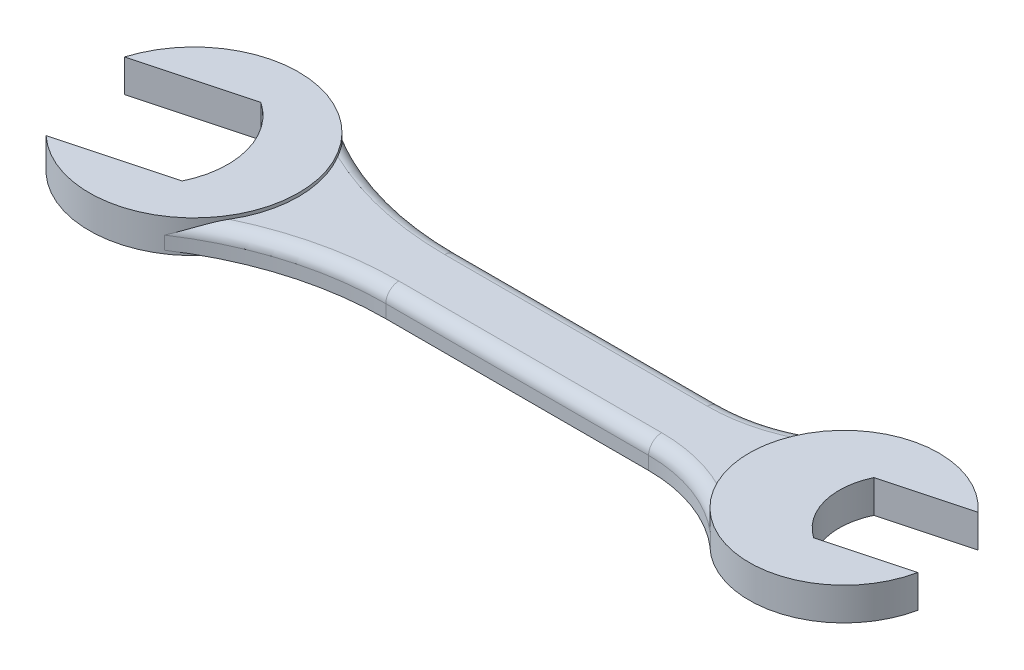
ISO-10303-21;
HEADER;
FILE_DESCRIPTION(('STEP AP214'),'2;1');
FILE_NAME('part.step','',(''),(''),'','','');
FILE_SCHEMA(('AUTOMOTIVE_DESIGN { 1 0 10303 214 1 1 1 1 }'));
ENDSEC;
DATA;
#1=APPLICATION_CONTEXT('core data for automotive mechanical design processes');
#2=APPLICATION_PROTOCOL_DEFINITION('international standard','automotive_design',2000,#1);
#3=PRODUCT_CONTEXT('',#1,'mechanical');
#4=PRODUCT('Part','Part','',(#3));
#5=PRODUCT_RELATED_PRODUCT_CATEGORY('part','',(#4));
#6=PRODUCT_DEFINITION_FORMATION('','',#4);
#7=PRODUCT_DEFINITION_CONTEXT('part definition',#1,'design');
#8=PRODUCT_DEFINITION('design','',#6,#7);
#9=PRODUCT_DEFINITION_SHAPE('','',#8);
#10=(LENGTH_UNIT() NAMED_UNIT(*) SI_UNIT(.MILLI.,.METRE.));
#11=(NAMED_UNIT(*) PLANE_ANGLE_UNIT() SI_UNIT($,.RADIAN.));
#12=(NAMED_UNIT(*) SI_UNIT($,.STERADIAN.) SOLID_ANGLE_UNIT());
#13=UNCERTAINTY_MEASURE_WITH_UNIT(LENGTH_MEASURE(1.E-05),#10,'distance_accuracy_value','');
#14=(GEOMETRIC_REPRESENTATION_CONTEXT(3) GLOBAL_UNCERTAINTY_ASSIGNED_CONTEXT((#13)) GLOBAL_UNIT_ASSIGNED_CONTEXT((#10,
#11,#12)) REPRESENTATION_CONTEXT('',''));
#15=CARTESIAN_POINT('',(0.,0.,0.));
#16=DIRECTION('',(0.,0.,1.));
#17=DIRECTION('',(1.,0.,0.));
#18=AXIS2_PLACEMENT_3D('',#15,#16,#17);
#19=CARTESIAN_POINT('',(0.,2.,5.23316081768353));
#20=DIRECTION('',(0.,0.,-1.));
#21=DIRECTION('',(-1.,0.,0.));
#22=AXIS2_PLACEMENT_3D('',#19,#20,#21);
#23=PLANE('',#22);
#24=DIRECTION('',(0.,-1.,0.));
#25=VECTOR('',#24,1.);
#26=CARTESIAN_POINT('',(77.067292786709,2.,5.23316081768353));
#27=LINE('',#26,#25);
#28=CARTESIAN_POINT('',(77.067292786709,0.,5.23316081768353));
#29=VERTEX_POINT('',#28);
#30=CARTESIAN_POINT('',(77.067292786709,-2.,5.23316081768353));
#31=VERTEX_POINT('',#30);
#32=EDGE_CURVE('E295',#29,#31,#27,.T.);
#33=ORIENTED_EDGE('',*,*,#32,.F.);
#34=DIRECTION('',(1.,0.,0.));
#35=VECTOR('',#34,1.);
#36=CARTESIAN_POINT('',(36.9077417173868,0.,5.23316081768353));
#37=LINE('',#36,#35);
#38=CARTESIAN_POINT('',(36.9077417173868,0.,5.23316081768353));
#39=VERTEX_POINT('',#38);
#40=EDGE_CURVE('E320',#29,#39,#37,.F.);
#41=ORIENTED_EDGE('',*,*,#40,.T.);
#42=DIRECTION('',(0.,-1.,0.));
#43=VECTOR('',#42,1.);
#44=CARTESIAN_POINT('',(36.9077417173868,2.,5.23316081768353));
#45=LINE('',#44,#43);
#46=CARTESIAN_POINT('',(36.9077417173868,-2.,5.23316081768353));
#47=VERTEX_POINT('',#46);
#48=EDGE_CURVE('E259',#39,#47,#45,.T.);
#49=ORIENTED_EDGE('',*,*,#48,.T.);
#50=DIRECTION('',(1.,0.,0.));
#51=VECTOR('',#50,1.);
#52=CARTESIAN_POINT('',(0.,-2.,5.23316081768353));
#53=LINE('',#52,#51);
#54=EDGE_CURVE('E252',#47,#31,#53,.T.);
#55=ORIENTED_EDGE('',*,*,#54,.T.);
#56=EDGE_LOOP('',(#33,#41,#49,#55));
#57=FACE_BOUND('',#56,.T.);
#58=ADVANCED_FACE('F40',(#57),#23,.F.);
#59=CARTESIAN_POINT('',(77.067292786709,2.,28.2331608176835));
#60=DIRECTION('',(0.,-1.,0.));
#61=DIRECTION('',(0.,0.,-1.));
#62=AXIS2_PLACEMENT_3D('',#59,#60,#61);
#63=CYLINDRICAL_SURFACE('',#62,23.);
#64=DIRECTION('',(0.,-1.,0.));
#65=VECTOR('',#64,1.);
#66=CARTESIAN_POINT('',(92.0155234512392,2.,10.7531608176835));
#67=LINE('',#66,#65);
#68=CARTESIAN_POINT('',(92.0155234512392,0.,10.7531608176835));
#69=VERTEX_POINT('',#68);
#70=CARTESIAN_POINT('',(92.0155234512392,-2.,10.7531608176835));
#71=VERTEX_POINT('',#70);
#72=EDGE_CURVE('E293',#69,#71,#67,.T.);
#73=ORIENTED_EDGE('',*,*,#72,.F.);
#74=CARTESIAN_POINT('',(77.067292786709,0.,28.2331608176835));
#75=DIRECTION('',(0.,1.,0.));
#76=DIRECTION('',(0.,0.,1.));
#77=AXIS2_PLACEMENT_3D('',#74,#75,#76);
#78=CIRCLE('',#77,23.);
#79=EDGE_CURVE('E58',#69,#29,#78,.T.);
#80=ORIENTED_EDGE('',*,*,#79,.T.);
#81=ORIENTED_EDGE('',*,*,#32,.T.);
#82=CARTESIAN_POINT('',(77.067292786709,-2.,28.2331608176835));
#83=DIRECTION('',(0.,1.,0.));
#84=DIRECTION('',(0.,0.,1.));
#85=AXIS2_PLACEMENT_3D('',#82,#83,#84);
#86=CIRCLE('',#85,23.);
#87=EDGE_CURVE('E262',#31,#71,#86,.F.);
#88=ORIENTED_EDGE('',*,*,#87,.T.);
#89=EDGE_LOOP('',(#73,#80,#81,#88));
#90=FACE_BOUND('',#89,.T.);
#91=ADVANCED_FACE('F399',(#90),#63,.F.);
#92=CARTESIAN_POINT('',(77.0672927867091,2.,-28.7668391823165));
#93=DIRECTION('',(0.,-1.,0.));
#94=DIRECTION('',(0.,0.,-1.));
#95=AXIS2_PLACEMENT_3D('',#92,#93,#94);
#96=CYLINDRICAL_SURFACE('',#95,23.);
#97=DIRECTION('',(0.,-1.,0.));
#98=VECTOR('',#97,1.);
#99=CARTESIAN_POINT('',(77.0672927867091,2.,-5.76683918231647));
#100=LINE('',#99,#98);
#101=CARTESIAN_POINT('',(77.0672927867091,0.,-5.76683918231647));
#102=VERTEX_POINT('',#101);
#103=CARTESIAN_POINT('',(77.0672927867091,-2.,-5.76683918231647));
#104=VERTEX_POINT('',#103);
#105=EDGE_CURVE('E289',#102,#104,#100,.T.);
#106=ORIENTED_EDGE('',*,*,#105,.F.);
#107=CARTESIAN_POINT('',(77.0672927867091,0.,-28.7668391823165));
#108=DIRECTION('',(0.,1.,0.));
#109=DIRECTION('',(0.,0.,1.));
#110=AXIS2_PLACEMENT_3D('',#107,#108,#109);
#111=CIRCLE('',#110,23.);
#112=CARTESIAN_POINT('',(92.0155234512392,0.,-11.2868391823165));
#113=VERTEX_POINT('',#112);
#114=EDGE_CURVE('E313',#102,#113,#111,.T.);
#115=ORIENTED_EDGE('',*,*,#114,.T.);
#116=DIRECTION('',(0.,-1.,0.));
#117=VECTOR('',#116,1.);
#118=CARTESIAN_POINT('',(92.0155234512392,2.,-11.2868391823165));
#119=LINE('',#118,#117);
#120=CARTESIAN_POINT('',(92.0155234512392,-2.,-11.2868391823165));
#121=VERTEX_POINT('',#120);
#122=EDGE_CURVE('E291',#113,#121,#119,.T.);
#123=ORIENTED_EDGE('',*,*,#122,.T.);
#124=CARTESIAN_POINT('',(77.0672927867091,-2.,-28.7668391823165));
#125=DIRECTION('',(0.,1.,0.));
#126=DIRECTION('',(0.,0.,1.));
#127=AXIS2_PLACEMENT_3D('',#124,#125,#126);
#128=CIRCLE('',#127,23.);
#129=EDGE_CURVE('E268',#121,#104,#128,.F.);
#130=ORIENTED_EDGE('',*,*,#129,.T.);
#131=EDGE_LOOP('',(#106,#115,#123,#130));
#132=FACE_BOUND('',#131,.T.);
#133=ADVANCED_FACE('F404',(#132),#96,.F.);
#134=CARTESIAN_POINT('',(0.,2.,-5.76683918231647));
#135=DIRECTION('',(0.,0.,-1.));
#136=DIRECTION('',(-1.,0.,0.));
#137=AXIS2_PLACEMENT_3D('',#134,#135,#136);
#138=PLANE('',#137);
#139=DIRECTION('',(0.,-1.,0.));
#140=VECTOR('',#139,1.);
#141=CARTESIAN_POINT('',(36.9077417173868,2.,-5.76683918231647));
#142=LINE('',#141,#140);
#143=CARTESIAN_POINT('',(36.9077417173868,0.,-5.76683918231647));
#144=VERTEX_POINT('',#143);
#145=CARTESIAN_POINT('',(36.9077417173868,-2.,-5.76683918231647));
#146=VERTEX_POINT('',#145);
#147=EDGE_CURVE('E287',#144,#146,#142,.T.);
#148=ORIENTED_EDGE('',*,*,#147,.F.);
#149=DIRECTION('',(1.,0.,0.));
#150=VECTOR('',#149,1.);
#151=CARTESIAN_POINT('',(0.,0.,-5.76683918231647));
#152=LINE('',#151,#150);
#153=EDGE_CURVE('E318',#144,#102,#152,.T.);
#154=ORIENTED_EDGE('',*,*,#153,.T.);
#155=ORIENTED_EDGE('',*,*,#105,.T.);
#156=DIRECTION('',(1.,0.,0.));
#157=VECTOR('',#156,1.);
#158=CARTESIAN_POINT('',(0.,-2.,-5.76683918231647));
#159=LINE('',#158,#157);
#160=EDGE_CURVE('E271',#146,#104,#159,.T.);
#161=ORIENTED_EDGE('',*,*,#160,.F.);
#162=EDGE_LOOP('',(#148,#154,#155,#161));
#163=FACE_BOUND('',#162,.T.);
#164=ADVANCED_FACE('F435',(#163),#138,.T.);
#165=CARTESIAN_POINT('',(36.9077417173868,2.,-52.7668391823165));
#166=DIRECTION('',(0.,-1.,0.));
#167=DIRECTION('',(0.,0.,-1.));
#168=AXIS2_PLACEMENT_3D('',#165,#166,#167);
#169=CYLINDRICAL_SURFACE('',#168,47.);
#170=DIRECTION('',(0.,-1.,0.));
#171=VECTOR('',#170,1.);
#172=CARTESIAN_POINT('',(10.9275141929362,2.,-13.6001725156498));
#173=LINE('',#172,#171);
#174=CARTESIAN_POINT('',(10.9275141929362,0.,-13.6001725156498));
#175=VERTEX_POINT('',#174);
#176=CARTESIAN_POINT('',(10.9275141929362,-2.,-13.6001725156498));
#177=VERTEX_POINT('',#176);
#178=EDGE_CURVE('E285',#175,#177,#173,.T.);
#179=ORIENTED_EDGE('',*,*,#178,.F.);
#180=CARTESIAN_POINT('',(36.9077417173868,0.,-52.7668391823165));
#181=DIRECTION('',(0.,1.,0.));
#182=DIRECTION('',(0.,0.,1.));
#183=AXIS2_PLACEMENT_3D('',#180,#181,#182);
#184=CIRCLE('',#183,47.);
#185=EDGE_CURVE('E297',#175,#144,#184,.T.);
#186=ORIENTED_EDGE('',*,*,#185,.T.);
#187=ORIENTED_EDGE('',*,*,#147,.T.);
#188=CARTESIAN_POINT('',(36.9077417173868,-2.,-52.7668391823165));
#189=DIRECTION('',(0.,1.,0.));
#190=DIRECTION('',(0.,0.,1.));
#191=AXIS2_PLACEMENT_3D('',#188,#189,#190);
#192=CIRCLE('',#191,47.);
#193=EDGE_CURVE('E274',#177,#146,#192,.T.);
#194=ORIENTED_EDGE('',*,*,#193,.F.);
#195=EDGE_LOOP('',(#179,#186,#187,#194));
#196=FACE_BOUND('',#195,.T.);
#197=ADVANCED_FACE('F432',(#196),#169,.F.);
#198=CARTESIAN_POINT('',(36.9077417173868,2.,52.2331608176835));
#199=DIRECTION('',(0.,-1.,0.));
#200=DIRECTION('',(0.,0.,-1.));
#201=AXIS2_PLACEMENT_3D('',#198,#199,#200);
#202=CYLINDRICAL_SURFACE('',#201,47.);
#203=ORIENTED_EDGE('',*,*,#48,.F.);
#204=CARTESIAN_POINT('',(36.9077417173868,0.,52.2331608176835));
#205=DIRECTION('',(0.,1.,0.));
#206=DIRECTION('',(0.,0.,1.));
#207=AXIS2_PLACEMENT_3D('',#204,#205,#206);
#208=CIRCLE('',#207,47.);
#209=CARTESIAN_POINT('',(10.9275141929362,0.,13.0664941510169));
#210=VERTEX_POINT('',#209);
#211=EDGE_CURVE('E315',#39,#210,#208,.T.);
#212=ORIENTED_EDGE('',*,*,#211,.T.);
#213=DIRECTION('',(0.,-1.,0.));
#214=VECTOR('',#213,1.);
#215=CARTESIAN_POINT('',(10.9275141929362,2.,13.0664941510169));
#216=LINE('',#215,#214);
#217=CARTESIAN_POINT('',(10.9275141929362,-2.,13.0664941510169));
#218=VERTEX_POINT('',#217);
#219=EDGE_CURVE('E283',#210,#218,#216,.T.);
#220=ORIENTED_EDGE('',*,*,#219,.T.);
#221=CARTESIAN_POINT('',(36.9077417173868,-2.,52.2331608176835));
#222=DIRECTION('',(0.,1.,0.));
#223=DIRECTION('',(0.,0.,1.));
#224=AXIS2_PLACEMENT_3D('',#221,#222,#223);
#225=CIRCLE('',#224,47.);
#226=EDGE_CURVE('E256',#218,#47,#225,.F.);
#227=ORIENTED_EDGE('',*,*,#226,.T.);
#228=EDGE_LOOP('',(#203,#212,#220,#227));
#229=FACE_BOUND('',#228,.T.);
#230=ADVANCED_FACE('F449',(#229),#202,.F.);
#231=CARTESIAN_POINT('',(0.,2.,0.));
#232=DIRECTION('',(0.,1.,0.));
#233=DIRECTION('',(0.,0.,1.));
#234=AXIS2_PLACEMENT_3D('',#231,#232,#233);
#235=PLANE('',#234);
#236=DIRECTION('',(1.,0.,0.));
#237=VECTOR('',#236,1.);
#238=CARTESIAN_POINT('',(0.,2.,-3.76683918231647));
#239=LINE('',#238,#237);
#240=CARTESIAN_POINT('',(77.0672927867091,2.,-3.76683918231647));
#241=VERTEX_POINT('',#240);
#242=CARTESIAN_POINT('',(36.9077417173868,2.,-3.76683918231647));
#243=VERTEX_POINT('',#242);
#244=EDGE_CURVE('E307',#241,#243,#239,.F.);
#245=ORIENTED_EDGE('',*,*,#244,.T.);
#246=CARTESIAN_POINT('',(36.9077417173868,2.,-52.7668391823165));
#247=DIRECTION('',(0.,1.,0.));
#248=DIRECTION('',(0.,0.,1.));
#249=AXIS2_PLACEMENT_3D('',#246,#247,#248);
#250=CIRCLE('',#249,49.);
#251=CARTESIAN_POINT('',(15.7640995858613,2.,-8.56337328410915));
#252=VERTEX_POINT('',#251);
#253=EDGE_CURVE('E311',#243,#252,#250,.F.);
#254=ORIENTED_EDGE('',*,*,#253,.T.);
#255=CARTESIAN_POINT('',(2.08318141865511,2.,-0.266839182316472));
#256=DIRECTION('',(0.,1.,0.));
#257=DIRECTION('',(0.,0.,1.));
#258=AXIS2_PLACEMENT_3D('',#255,#256,#257);
#259=CIRCLE('',#258,16.);
#260=CARTESIAN_POINT('',(15.7640995858613,2.,8.02969491947621));
#261=VERTEX_POINT('',#260);
#262=EDGE_CURVE('E255',#261,#252,#259,.T.);
#263=ORIENTED_EDGE('',*,*,#262,.F.);
#264=CARTESIAN_POINT('',(36.9077417173868,2.,52.2331608176835));
#265=DIRECTION('',(0.,1.,0.));
#266=DIRECTION('',(0.,0.,1.));
#267=AXIS2_PLACEMENT_3D('',#264,#265,#266);
#268=CIRCLE('',#267,49.);
#269=CARTESIAN_POINT('',(36.9077417173868,2.,3.23316081768353));
#270=VERTEX_POINT('',#269);
#271=EDGE_CURVE('E304',#261,#270,#268,.F.);
#272=ORIENTED_EDGE('',*,*,#271,.T.);
#273=DIRECTION('',(1.,0.,0.));
#274=VECTOR('',#273,1.);
#275=CARTESIAN_POINT('',(77.067292786709,2.,3.23316081768353));
#276=LINE('',#275,#274);
#277=CARTESIAN_POINT('',(77.067292786709,2.,3.23316081768353));
#278=VERTEX_POINT('',#277);
#279=EDGE_CURVE('E300',#270,#278,#276,.T.);
#280=ORIENTED_EDGE('',*,*,#279,.T.);
#281=CARTESIAN_POINT('',(77.067292786709,2.,28.2331608176835));
#282=DIRECTION('',(0.,1.,0.));
#283=DIRECTION('',(0.,0.,1.));
#284=AXIS2_PLACEMENT_3D('',#281,#282,#283);
#285=CIRCLE('',#284,25.);
#286=CARTESIAN_POINT('',(88.3203760378165,2.,5.90900087058484));
#287=VERTEX_POINT('',#286);
#288=EDGE_CURVE('E302',#278,#287,#285,.F.);
#289=ORIENTED_EDGE('',*,*,#288,.T.);
#290=CARTESIAN_POINT('',(101.439408000617,2.,-0.266839182316472));
#291=DIRECTION('',(0.,1.,0.));
#292=DIRECTION('',(0.,0.,1.));
#293=AXIS2_PLACEMENT_3D('',#290,#291,#292);
#294=CIRCLE('',#293,14.5);
#295=CARTESIAN_POINT('',(88.3203760378165,2.,-6.44267923521779));
#296=VERTEX_POINT('',#295);
#297=EDGE_CURVE('E253',#296,#287,#294,.T.);
#298=ORIENTED_EDGE('',*,*,#297,.F.);
#299=CARTESIAN_POINT('',(77.0672927867091,2.,-28.7668391823165));
#300=DIRECTION('',(0.,1.,0.));
#301=DIRECTION('',(0.,0.,1.));
#302=AXIS2_PLACEMENT_3D('',#299,#300,#301);
#303=CIRCLE('',#302,25.);
#304=EDGE_CURVE('E309',#296,#241,#303,.F.);
#305=ORIENTED_EDGE('',*,*,#304,.T.);
#306=EDGE_LOOP('',(#245,#254,#263,#272,#280,#289,#298,#305));
#307=FACE_BOUND('',#306,.T.);
#308=ADVANCED_FACE('F447',(#307),#235,.T.);
#309=CARTESIAN_POINT('',(0.,-2.,0.));
#310=DIRECTION('',(0.,1.,0.));
#311=DIRECTION('',(0.,0.,1.));
#312=AXIS2_PLACEMENT_3D('',#309,#310,#311);
#313=PLANE('',#312);
#314=ORIENTED_EDGE('',*,*,#54,.F.);
#315=ORIENTED_EDGE('',*,*,#226,.F.);
#316=CARTESIAN_POINT('',(2.08318141865511,-2.,-0.266839182316472));
#317=DIRECTION('',(0.,1.,0.));
#318=DIRECTION('',(0.,0.,1.));
#319=AXIS2_PLACEMENT_3D('',#316,#317,#318);
#320=CIRCLE('',#319,16.);
#321=EDGE_CURVE('E277',#218,#177,#320,.T.);
#322=ORIENTED_EDGE('',*,*,#321,.T.);
#323=ORIENTED_EDGE('',*,*,#193,.T.);
#324=ORIENTED_EDGE('',*,*,#160,.T.);
#325=ORIENTED_EDGE('',*,*,#129,.F.);
#326=CARTESIAN_POINT('',(101.439408000617,-2.,-0.266839182316472));
#327=DIRECTION('',(0.,1.,0.));
#328=DIRECTION('',(0.,0.,1.));
#329=AXIS2_PLACEMENT_3D('',#326,#327,#328);
#330=CIRCLE('',#329,14.5);
#331=EDGE_CURVE('E265',#121,#71,#330,.T.);
#332=ORIENTED_EDGE('',*,*,#331,.T.);
#333=ORIENTED_EDGE('',*,*,#87,.F.);
#334=EDGE_LOOP('',(#314,#315,#322,#323,#324,#325,#332,#333));
#335=FACE_BOUND('',#334,.T.);
#336=ADVANCED_FACE('F438',(#335),#313,.F.);
#337=CARTESIAN_POINT('',(-2.12712498424651,2.5,-7.9385385152571));
#338=DIRECTION('',(-0.258819045102521,0.,-0.965925826289068));
#339=DIRECTION('',(-0.965925826289068,0.,0.258819045102521));
#340=AXIS2_PLACEMENT_3D('',#337,#338,#339);
#341=PLANE('',#340);
#342=DIRECTION('',(0.965925826289068,0.,-0.258819045102521));
#343=VECTOR('',#342,1.);
#344=CARTESIAN_POINT('',(-2.12712498424651,-2.5,-7.9385385152571));
#345=LINE('',#344,#343);
#346=CARTESIAN_POINT('',(-13.2103317008285,-2.5,-4.96880222600175));
#347=VERTEX_POINT('',#346);
#348=CARTESIAN_POINT('',(3.21040734608564,-2.5,-9.36872599274461));
#349=VERTEX_POINT('',#348);
#350=EDGE_CURVE('E188',#347,#349,#345,.T.);
#351=ORIENTED_EDGE('',*,*,#350,.T.);
#352=DIRECTION('',(0.,-1.,0.));
#353=VECTOR('',#352,1.);
#354=CARTESIAN_POINT('',(3.21040734608564,2.5,-9.36872599274461));
#355=LINE('',#354,#353);
#356=CARTESIAN_POINT('',(3.21040734608564,2.5,-9.36872599274461));
#357=VERTEX_POINT('',#356);
#358=EDGE_CURVE('E249',#357,#349,#355,.T.);
#359=ORIENTED_EDGE('',*,*,#358,.F.);
#360=DIRECTION('',(0.965925826289068,0.,-0.258819045102521));
#361=VECTOR('',#360,1.);
#362=CARTESIAN_POINT('',(-2.12712498424651,2.5,-7.9385385152571));
#363=LINE('',#362,#361);
#364=CARTESIAN_POINT('',(-13.2103317008285,2.5,-4.96880222600175));
#365=VERTEX_POINT('',#364);
#366=EDGE_CURVE('E222',#365,#357,#363,.T.);
#367=ORIENTED_EDGE('',*,*,#366,.F.);
#368=DIRECTION('',(0.,-1.,0.));
#369=VECTOR('',#368,1.);
#370=CARTESIAN_POINT('',(-13.2103317008285,2.5,-4.96880222600175));
#371=LINE('',#370,#369);
#372=EDGE_CURVE('E233',#365,#347,#371,.T.);
#373=ORIENTED_EDGE('',*,*,#372,.T.);
#374=EDGE_LOOP('',(#351,#359,#367,#373));
#375=FACE_BOUND('',#374,.T.);
#376=ADVANCED_FACE('F471',(#375),#341,.F.);
#377=CARTESIAN_POINT('',(-4.09062960793219,2.5,1.38742849647996));
#378=DIRECTION('',(0.,-1.,0.));
#379=DIRECTION('',(0.,0.,-1.));
#380=AXIS2_PLACEMENT_3D('',#377,#378,#379);
#381=CYLINDRICAL_SURFACE('',#380,13.);
#382=CARTESIAN_POINT('',(-4.09062960793219,-2.5,1.38742849647996));
#383=DIRECTION('',(0.,1.,0.));
#384=DIRECTION('',(0.,0.,1.));
#385=AXIS2_PLACEMENT_3D('',#382,#383,#384);
#386=CIRCLE('',#385,13.);
#387=CARTESIAN_POINT('',(7.61033111282851,-2.5,7.05201305416954));
#388=VERTEX_POINT('',#387);
#389=EDGE_CURVE('E236',#349,#388,#386,.F.);
#390=ORIENTED_EDGE('',*,*,#389,.T.);
#391=DIRECTION('',(0.,-1.,0.));
#392=VECTOR('',#391,1.);
#393=CARTESIAN_POINT('',(7.61033111282851,2.5,7.05201305416954));
#394=LINE('',#393,#392);
#395=CARTESIAN_POINT('',(7.61033111282851,2.5,7.05201305416954));
#396=VERTEX_POINT('',#395);
#397=EDGE_CURVE('E247',#396,#388,#394,.T.);
#398=ORIENTED_EDGE('',*,*,#397,.F.);
#399=CARTESIAN_POINT('',(-4.09062960793219,2.5,1.38742849647996));
#400=DIRECTION('',(0.,1.,0.));
#401=DIRECTION('',(0.,0.,1.));
#402=AXIS2_PLACEMENT_3D('',#399,#400,#401);
#403=CIRCLE('',#402,13.);
#404=EDGE_CURVE('E225',#357,#396,#403,.F.);
#405=ORIENTED_EDGE('',*,*,#404,.F.);
#406=ORIENTED_EDGE('',*,*,#358,.T.);
#407=EDGE_LOOP('',(#390,#398,#405,#406));
#408=FACE_BOUND('',#407,.T.);
#409=ADVANCED_FACE('F476',(#408),#381,.F.);
#410=CARTESIAN_POINT('',(2.27279878249636,2.5,8.48220053165706));
#411=DIRECTION('',(-0.258819045102522,0.,-0.965925826289068));
#412=DIRECTION('',(-0.965925826289068,0.,0.258819045102522));
#413=AXIS2_PLACEMENT_3D('',#410,#411,#412);
#414=PLANE('',#413);
#415=DIRECTION('',(0.965925826289068,0.,-0.258819045102522));
#416=VECTOR('',#415,1.);
#417=CARTESIAN_POINT('',(2.27279878249636,-2.5,8.48220053165706));
#418=LINE('',#417,#416);
#419=CARTESIAN_POINT('',(-8.81040793408566,-2.5,11.4519368209124));
#420=VERTEX_POINT('',#419);
#421=EDGE_CURVE('E239',#420,#388,#418,.T.);
#422=ORIENTED_EDGE('',*,*,#421,.F.);
#423=DIRECTION('',(0.,-1.,0.));
#424=VECTOR('',#423,1.);
#425=CARTESIAN_POINT('',(-8.81040793408566,2.5,11.4519368209124));
#426=LINE('',#425,#424);
#427=CARTESIAN_POINT('',(-8.81040793408566,2.5,11.4519368209124));
#428=VERTEX_POINT('',#427);
#429=EDGE_CURVE('E245',#428,#420,#426,.T.);
#430=ORIENTED_EDGE('',*,*,#429,.F.);
#431=DIRECTION('',(0.965925826289068,0.,-0.258819045102522));
#432=VECTOR('',#431,1.);
#433=CARTESIAN_POINT('',(2.27279878249636,2.5,8.48220053165706));
#434=LINE('',#433,#432);
#435=EDGE_CURVE('E228',#428,#396,#434,.T.);
#436=ORIENTED_EDGE('',*,*,#435,.T.);
#437=ORIENTED_EDGE('',*,*,#397,.T.);
#438=EDGE_LOOP('',(#422,#430,#436,#437));
#439=FACE_BOUND('',#438,.T.);
#440=ADVANCED_FACE('F479',(#439),#414,.T.);
#441=CARTESIAN_POINT('',(2.08318141865511,2.5,-0.266839182316472));
#442=DIRECTION('',(0.,-1.,0.));
#443=DIRECTION('',(0.,0.,-1.));
#444=AXIS2_PLACEMENT_3D('',#441,#442,#443);
#445=CYLINDRICAL_SURFACE('',#444,16.);
#446=ORIENTED_EDGE('',*,*,#219,.F.);
#447=CARTESIAN_POINT('',(15.7640995858613,2.,8.0296949194762));
#448=CARTESIAN_POINT('',(15.7051216373425,1.9999843806869,8.12695484532717));
#449=CARTESIAN_POINT('',(15.645118078396,1.99709083883942,8.22355556631939));
#450=CARTESIAN_POINT('',(15.523232207495,1.98615788210015,8.41520543730429));
#451=CARTESIAN_POINT('',(15.461350865882,1.97812108325347,8.51025535090315));
#452=CARTESIAN_POINT('',(15.3359800097926,1.95753633293143,8.69843200552531));
#453=CARTESIAN_POINT('',(15.2724949464662,1.94499981383135,8.79156299353643));
#454=CARTESIAN_POINT('',(15.1438726218546,1.91591367334567,8.97604962423704));
#455=CARTESIAN_POINT('',(15.0787351256761,1.89936347852113,9.06740501122786));
#456=CARTESIAN_POINT('',(14.8819612075849,1.84464618904969,9.33735631261407));
#457=CARTESIAN_POINT('',(14.7480289992802,1.80124521661407,9.51323742432781));
#458=CARTESIAN_POINT('',(14.4745419921549,1.70330869468986,9.85751670777813));
#459=CARTESIAN_POINT('',(14.3349826009083,1.64876389664471,10.0259085216747));
#460=CARTESIAN_POINT('',(14.0714042212251,1.53942240198354,10.3311344459638));
#461=CARTESIAN_POINT('',(13.9480761415241,1.4858154948111,10.4689970232179));
#462=CARTESIAN_POINT('',(13.6978461067981,1.37332398246491,10.7392263198067));
#463=CARTESIAN_POINT('',(13.57094368528,1.3144386861907,10.8715923161433));
#464=CARTESIAN_POINT('',(13.185024471558,1.13138147134608,11.2606321348263));
#465=CARTESIAN_POINT('',(12.9208272023438,1.00082180068042,11.5092114706337));
#466=CARTESIAN_POINT('',(12.3788127504241,0.729085304966929,11.9859386664662));
#467=CARTESIAN_POINT('',(12.1009675463046,0.587886288887699,12.2140415188983));
#468=CARTESIAN_POINT('',(11.5323671763325,0.300548852123904,12.6498588533863));
#469=CARTESIAN_POINT('',(11.2416189594574,0.154413100029043,12.8575841209156));
#470=CARTESIAN_POINT('',(10.9387464129818,0.00551841287635088,13.0590384216527));
#471=CARTESIAN_POINT('',(10.9331314636301,0.00275919795564087,13.0627680691731));
#472=CARTESIAN_POINT('',(10.9275141929362,0.,13.0664941510169));
#473=B_SPLINE_CURVE_WITH_KNOTS('',3,(#447,#448,#449,#450,#451,#452,#453,#454,#455,#456,#457,
#458,#459,#460,#461,#462,#463,#464,#465,#466,#467,#468,#469,#470,#471,#472),.UNSPECIFIED.,.F.,
.F.,(4,2,2,2,2,2,2,2,2,2,2,2,4),(0.,0.341145721233518,0.682118061269982,1.02223015964995,
1.36239087893316,2.03765187377819,2.71347557891094,3.29103354894892,3.86866724952371,
5.02408400072435,6.18198118237266,7.33926216621925,7.36111303532719),.UNSPECIFIED.);
#474=EDGE_CURVE('E50',#210,#261,#473,.F.);
#475=ORIENTED_EDGE('',*,*,#474,.T.);
#476=ORIENTED_EDGE('',*,*,#262,.T.);
#477=CARTESIAN_POINT('',(15.7640995858613,2.,-8.56337328410915));
#478=CARTESIAN_POINT('',(15.7051216373425,1.9999843806869,-8.66063320996012));
#479=CARTESIAN_POINT('',(15.645118078396,1.99709083883942,-8.75723393095234));
#480=CARTESIAN_POINT('',(15.523232207495,1.98615788210015,-8.94888380193723));
#481=CARTESIAN_POINT('',(15.461350865882,1.97812108325347,-9.04393371553609));
#482=CARTESIAN_POINT('',(15.3359800097926,1.95753633293143,-9.23211037015825));
#483=CARTESIAN_POINT('',(15.2724949464662,1.94499981383135,-9.32524135816937));
#484=CARTESIAN_POINT('',(15.1438726218546,1.91591367334567,-9.50972798886999));
#485=CARTESIAN_POINT('',(15.0787351256761,1.89936347852113,-9.60108337586081));
#486=CARTESIAN_POINT('',(14.8819612075849,1.84464618904969,-9.87103467724702));
#487=CARTESIAN_POINT('',(14.7480289992802,1.80124521661407,-10.0469157889608));
#488=CARTESIAN_POINT('',(14.4745419921549,1.70330869468985,-10.3911950724111));
#489=CARTESIAN_POINT('',(14.3349826009083,1.64876389664471,-10.5595868863077));
#490=CARTESIAN_POINT('',(14.0714042212251,1.53942240198354,-10.8648128105967));
#491=CARTESIAN_POINT('',(13.9480761415241,1.4858154948111,-11.0026753878508));
#492=CARTESIAN_POINT('',(13.6978461067981,1.37332398246491,-11.2729046844396));
#493=CARTESIAN_POINT('',(13.57094368528,1.3144386861907,-11.4052706807763));
#494=CARTESIAN_POINT('',(13.185024471558,1.13138147134608,-11.7943104994592));
#495=CARTESIAN_POINT('',(12.9208272023438,1.00082180068041,-12.0428898352667));
#496=CARTESIAN_POINT('',(12.3788127504241,0.72908530496694,-12.5196170310992));
#497=CARTESIAN_POINT('',(12.1009675463046,0.587886288887742,-12.7477198835312));
#498=CARTESIAN_POINT('',(11.5323671763325,0.300548852123942,-13.1835372180193));
#499=CARTESIAN_POINT('',(11.2416189594574,0.154413100029043,-13.3912624855486));
#500=CARTESIAN_POINT('',(10.9387464129818,0.00551841287635086,-13.5927167862857));
#501=CARTESIAN_POINT('',(10.9331314636301,0.00275919795564085,-13.5964464338061));
#502=CARTESIAN_POINT('',(10.9275141929362,0.,-13.6001725156498));
#503=B_SPLINE_CURVE_WITH_KNOTS('',3,(#477,#478,#479,#480,#481,#482,#483,#484,#485,#486,#487,
#488,#489,#490,#491,#492,#493,#494,#495,#496,#497,#498,#499,#500,#501,#502),.UNSPECIFIED.,.F.,
.F.,(4,2,2,2,2,2,2,2,2,2,2,2,4),(0.,0.341145721233518,0.682118061269982,1.02223015964995,
1.36239087893316,2.03765187377819,2.71347557891094,3.29103354894893,3.86866724952371,
5.02408400072435,6.18198118237266,7.33926216621925,7.36111303532719),.UNSPECIFIED.);
#504=EDGE_CURVE('E322',#252,#175,#503,.T.);
#505=ORIENTED_EDGE('',*,*,#504,.T.);
#506=ORIENTED_EDGE('',*,*,#178,.T.);
#507=ORIENTED_EDGE('',*,*,#321,.F.);
#508=EDGE_LOOP('',(#446,#475,#476,#505,#506,#507));
#509=FACE_BOUND('',#508,.T.);
#510=CARTESIAN_POINT('',(2.08318141865511,-2.5,-0.266839182316472));
#511=DIRECTION('',(0.,1.,0.));
#512=DIRECTION('',(0.,0.,1.));
#513=AXIS2_PLACEMENT_3D('',#510,#511,#512);
#514=CIRCLE('',#513,16.);
#515=EDGE_CURVE('E226',#420,#347,#514,.T.);
#516=ORIENTED_EDGE('',*,*,#515,.T.);
#517=ORIENTED_EDGE('',*,*,#372,.F.);
#518=CARTESIAN_POINT('',(2.08318141865511,2.5,-0.266839182316472));
#519=DIRECTION('',(0.,1.,0.));
#520=DIRECTION('',(0.,0.,1.));
#521=AXIS2_PLACEMENT_3D('',#518,#519,#520);
#522=CIRCLE('',#521,16.);
#523=EDGE_CURVE('E231',#428,#365,#522,.T.);
#524=ORIENTED_EDGE('',*,*,#523,.F.);
#525=ORIENTED_EDGE('',*,*,#429,.T.);
#526=EDGE_LOOP('',(#516,#517,#524,#525));
#527=FACE_BOUND('',#526,.T.);
#528=ADVANCED_FACE('F338',(#509,#527),#445,.T.);
#529=CARTESIAN_POINT('',(0.,2.5,0.));
#530=DIRECTION('',(0.,1.,0.));
#531=DIRECTION('',(0.,0.,1.));
#532=AXIS2_PLACEMENT_3D('',#529,#530,#531);
#533=PLANE('',#532);
#534=ORIENTED_EDGE('',*,*,#366,.T.);
#535=ORIENTED_EDGE('',*,*,#404,.T.);
#536=ORIENTED_EDGE('',*,*,#435,.F.);
#537=ORIENTED_EDGE('',*,*,#523,.T.);
#538=EDGE_LOOP('',(#534,#535,#536,#537));
#539=FACE_BOUND('',#538,.T.);
#540=ADVANCED_FACE('F390',(#539),#533,.T.);
#541=CARTESIAN_POINT('',(0.,-2.5,0.));
#542=DIRECTION('',(0.,1.,0.));
#543=DIRECTION('',(0.,0.,1.));
#544=AXIS2_PLACEMENT_3D('',#541,#542,#543);
#545=PLANE('',#544);
#546=ORIENTED_EDGE('',*,*,#350,.F.);
#547=ORIENTED_EDGE('',*,*,#515,.F.);
#548=ORIENTED_EDGE('',*,*,#421,.T.);
#549=ORIENTED_EDGE('',*,*,#389,.F.);
#550=EDGE_LOOP('',(#546,#547,#548,#549));
#551=FACE_BOUND('',#550,.T.);
#552=ADVANCED_FACE('F389',(#551),#545,.F.);
#553=CARTESIAN_POINT('',(8.41076586120137,2.5,31.3894055245693));
#554=DIRECTION('',(-0.258819045102521,0.,-0.965925826289068));
#555=DIRECTION('',(-0.965925826289068,0.,0.258819045102521));
#556=AXIS2_PLACEMENT_3D('',#553,#554,#555);
#557=PLANE('',#556);
#558=DIRECTION('',(0.965925826289068,0.,-0.258819045102521));
#559=VECTOR('',#558,1.);
#560=CARTESIAN_POINT('',(8.41076586120137,-2.5,31.3894055245693));
#561=LINE('',#560,#559);
#562=CARTESIAN_POINT('',(103.084525680175,-2.5,6.0216480366573));
#563=VERTEX_POINT('',#562);
#564=CARTESIAN_POINT('',(115.641561421933,-2.5,2.65700045032453));
#565=VERTEX_POINT('',#564);
#566=EDGE_CURVE('E185',#563,#565,#561,.T.);
#567=ORIENTED_EDGE('',*,*,#566,.F.);
#568=DIRECTION('',(0.,-1.,0.));
#569=VECTOR('',#568,1.);
#570=CARTESIAN_POINT('',(103.084525680175,2.5,6.0216480366573));
#571=LINE('',#570,#569);
#572=CARTESIAN_POINT('',(103.084525680175,2.5,6.0216480366573));
#573=VERTEX_POINT('',#572);
#574=EDGE_CURVE('E179',#573,#563,#571,.T.);
#575=ORIENTED_EDGE('',*,*,#574,.F.);
#576=DIRECTION('',(0.965925826289068,0.,-0.258819045102521));
#577=VECTOR('',#576,1.);
#578=CARTESIAN_POINT('',(8.41076586120137,2.5,31.3894055245693));
#579=LINE('',#578,#577);
#580=CARTESIAN_POINT('',(115.641561421933,2.5,2.65700045032453));
#581=VERTEX_POINT('',#580);
#582=EDGE_CURVE('E183',#573,#581,#579,.T.);
#583=ORIENTED_EDGE('',*,*,#582,.T.);
#584=DIRECTION('',(0.,-1.,0.));
#585=VECTOR('',#584,1.);
#586=CARTESIAN_POINT('',(115.641561421933,2.5,2.65700045032453));
#587=LINE('',#586,#585);
#588=EDGE_CURVE('E211',#581,#565,#587,.T.);
#589=ORIENTED_EDGE('',*,*,#588,.T.);
#590=EDGE_LOOP('',(#567,#575,#583,#589));
#591=FACE_BOUND('',#590,.T.);
#592=ADVANCED_FACE('F181',(#591),#557,.T.);
#593=CARTESIAN_POINT('',(108.742602661781,2.5,-2.22372429394263));
#594=DIRECTION('',(0.,-1.,0.));
#595=DIRECTION('',(0.,0.,-1.));
#596=AXIS2_PLACEMENT_3D('',#593,#594,#595);
#597=CYLINDRICAL_SURFACE('',#596,9.99999999999999);
#598=CARTESIAN_POINT('',(108.742602661781,-2.5,-2.22372429394263));
#599=DIRECTION('',(0.,1.,0.));
#600=DIRECTION('',(0.,0.,1.));
#601=AXIS2_PLACEMENT_3D('',#598,#599,#600);
#602=CIRCLE('',#601,9.99999999999999);
#603=CARTESIAN_POINT('',(99.7198780938423,-2.5,-6.53538770510057));
#604=VERTEX_POINT('',#603);
#605=EDGE_CURVE('E213',#563,#604,#602,.F.);
#606=ORIENTED_EDGE('',*,*,#605,.T.);
#607=DIRECTION('',(0.,-1.,0.));
#608=VECTOR('',#607,1.);
#609=CARTESIAN_POINT('',(99.7198780938423,2.5,-6.53538770510057));
#610=LINE('',#609,#608);
#611=CARTESIAN_POINT('',(99.7198780938423,2.5,-6.53538770510057));
#612=VERTEX_POINT('',#611);
#613=EDGE_CURVE('E189',#612,#604,#610,.T.);
#614=ORIENTED_EDGE('',*,*,#613,.F.);
#615=CARTESIAN_POINT('',(108.742602661781,2.5,-2.22372429394263));
#616=DIRECTION('',(0.,1.,0.));
#617=DIRECTION('',(0.,0.,1.));
#618=AXIS2_PLACEMENT_3D('',#615,#616,#617);
#619=CIRCLE('',#618,9.99999999999999);
#620=EDGE_CURVE('E192',#573,#612,#619,.F.);
#621=ORIENTED_EDGE('',*,*,#620,.F.);
#622=ORIENTED_EDGE('',*,*,#574,.T.);
#623=EDGE_LOOP('',(#606,#614,#621,#622));
#624=FACE_BOUND('',#623,.T.);
#625=ADVANCED_FACE('F193',(#624),#597,.F.);
#626=CARTESIAN_POINT('',(5.04611827486865,2.5,18.8323697828116));
#627=DIRECTION('',(-0.258819045102522,0.,-0.965925826289068));
#628=DIRECTION('',(-0.965925826289068,0.,0.258819045102522));
#629=AXIS2_PLACEMENT_3D('',#626,#627,#628);
#630=PLANE('',#629);
#631=DIRECTION('',(0.965925826289068,0.,-0.258819045102522));
#632=VECTOR('',#631,1.);
#633=CARTESIAN_POINT('',(5.04611827486865,-2.5,18.8323697828116));
#634=LINE('',#633,#632);
#635=CARTESIAN_POINT('',(112.2769138356,-2.5,-9.90003529143336));
#636=VERTEX_POINT('',#635);
#637=EDGE_CURVE('E206',#604,#636,#634,.T.);
#638=ORIENTED_EDGE('',*,*,#637,.T.);
#639=DIRECTION('',(0.,-1.,0.));
#640=VECTOR('',#639,1.);
#641=CARTESIAN_POINT('',(112.2769138356,2.5,-9.90003529143336));
#642=LINE('',#641,#640);
#643=CARTESIAN_POINT('',(112.2769138356,2.5,-9.90003529143336));
#644=VERTEX_POINT('',#643);
#645=EDGE_CURVE('E218',#644,#636,#642,.T.);
#646=ORIENTED_EDGE('',*,*,#645,.F.);
#647=DIRECTION('',(0.965925826289068,0.,-0.258819045102522));
#648=VECTOR('',#647,1.);
#649=CARTESIAN_POINT('',(5.04611827486865,2.5,18.8323697828116));
#650=LINE('',#649,#648);
#651=EDGE_CURVE('E197',#612,#644,#650,.T.);
#652=ORIENTED_EDGE('',*,*,#651,.F.);
#653=ORIENTED_EDGE('',*,*,#613,.T.);
#654=EDGE_LOOP('',(#638,#646,#652,#653));
#655=FACE_BOUND('',#654,.T.);
#656=ADVANCED_FACE('F379',(#655),#630,.F.);
#657=CARTESIAN_POINT('',(101.439408000617,2.5,-0.266839182316472));
#658=DIRECTION('',(0.,-1.,0.));
#659=DIRECTION('',(0.,0.,-1.));
#660=AXIS2_PLACEMENT_3D('',#657,#658,#659);
#661=CYLINDRICAL_SURFACE('',#660,14.5);
#662=ORIENTED_EDGE('',*,*,#122,.F.);
#663=CARTESIAN_POINT('',(88.3203760378165,2.,-6.44267923521779));
#664=CARTESIAN_POINT('',(88.3552875311076,1.99999507270207,-6.51684250884446));
#665=CARTESIAN_POINT('',(88.3908203337978,1.99808720481864,-6.59068839887941));
#666=CARTESIAN_POINT('',(88.4630488700936,1.99079174357156,-6.7376038403932));
#667=CARTESIAN_POINT('',(88.4997441616477,1.98540545816924,-6.81067367319343));
#668=CARTESIAN_POINT('',(88.6113269916484,1.96454680502818,-7.02826370535939));
#669=CARTESIAN_POINT('',(88.6878689407927,1.94437166378081,-7.17149864861571));
#670=CARTESIAN_POINT('',(88.8441835248869,1.89387521188749,-7.45265805376122));
#671=CARTESIAN_POINT('',(88.9239230647209,1.86364184226465,-7.59061737198708));
#672=CARTESIAN_POINT('',(89.0869558325576,1.79471229098303,-7.86236741776492));
#673=CARTESIAN_POINT('',(89.1702515170947,1.75601018053752,-7.996155149533));
#674=CARTESIAN_POINT('',(89.3388634528968,1.67221404757029,-8.25750020257885));
#675=CARTESIAN_POINT('',(89.4241339455698,1.62721905619893,-8.38511916812353));
#676=CARTESIAN_POINT('',(89.5976380875931,1.53158646041924,-8.63617433957551));
#677=CARTESIAN_POINT('',(89.6858723124569,1.48094775560697,-8.75960972363355));
#678=CARTESIAN_POINT('',(89.9548804493286,1.32203537954105,-9.12385998006917));
#679=CARTESIAN_POINT('',(90.139900410235,1.20679634363397,-9.35852729586027));
#680=CARTESIAN_POINT('',(90.5213572122835,0.963671512138675,-9.81328674891629));
#681=CARTESIAN_POINT('',(90.7178404456185,0.835732610850694,-10.0333106539938));
#682=CARTESIAN_POINT('',(91.1213458229756,0.572682766483208,-10.4586737693073));
#683=CARTESIAN_POINT('',(91.3283633175215,0.437574986404692,-10.6640193634644));
#684=CARTESIAN_POINT('',(91.6919560689871,0.203862738537735,-11.0036880187593));
#685=CARTESIAN_POINT('',(91.8458427547818,0.105978772490334,-11.1414023957619));
#686=CARTESIAN_POINT('',(92.0068911431122,0.00538772350857009,-11.2794527656873));
#687=CARTESIAN_POINT('',(92.0112062176457,0.00269385921155254,-11.2831472453043));
#688=CARTESIAN_POINT('',(92.0155234512392,0.,-11.2868391823165));
#689=B_SPLINE_CURVE_WITH_KNOTS('',3,(#663,#664,#665,#666,#667,#668,#669,#670,#671,#672,#673,
#674,#675,#676,#677,#678,#679,#680,#681,#682,#683,#684,#685,#686,#687,#688),.UNSPECIFIED.,.F.,
.F.,(4,2,2,2,2,2,2,2,2,2,2,2,4),(0.,0.245847101154641,0.491601812187703,0.98200670590396,
1.46823189422117,1.95479857382996,2.43442600099776,2.91414710944764,3.87392866976722,
4.83790777959061,5.8014650500378,6.48688775982716,6.50574865677364),.UNSPECIFIED.);
#690=EDGE_CURVE('E330',#113,#296,#689,.F.);
#691=ORIENTED_EDGE('',*,*,#690,.T.);
#692=ORIENTED_EDGE('',*,*,#297,.T.);
#693=CARTESIAN_POINT('',(88.3203760378165,2.,5.90900087058484));
#694=CARTESIAN_POINT('',(88.3552875311075,1.99999507270207,5.98316414421142));
#695=CARTESIAN_POINT('',(88.3908203337977,1.99808720481864,6.05701003424628));
#696=CARTESIAN_POINT('',(88.4630488700934,1.99079174357158,6.20392547575989));
#697=CARTESIAN_POINT('',(88.4997441616475,1.98540545816927,6.27699530856003));
#698=CARTESIAN_POINT('',(88.6113269916481,1.96454680502827,6.49458534072575));
#699=CARTESIAN_POINT('',(88.6878689407923,1.94437166378093,6.63782028398193));
#700=CARTESIAN_POINT('',(88.8441835248865,1.89387521188765,6.91897968912749));
#701=CARTESIAN_POINT('',(88.9239230647205,1.8636418422648,7.05693900735353));
#702=CARTESIAN_POINT('',(89.0869558325575,1.79471229098311,7.32868905313169));
#703=CARTESIAN_POINT('',(89.1702515170946,1.75601018053756,7.46247678489991));
#704=CARTESIAN_POINT('',(89.3388634528968,1.67221404757028,7.72382183794593));
#705=CARTESIAN_POINT('',(89.4241339455698,1.62721905619892,7.85144080349064));
#706=CARTESIAN_POINT('',(89.5976380875932,1.53158646041918,8.10249597494267));
#707=CARTESIAN_POINT('',(89.685872312457,1.48094775560688,8.22593135900073));
#708=CARTESIAN_POINT('',(89.9548804493288,1.32203537954097,8.59018161543653));
#709=CARTESIAN_POINT('',(90.1399004102355,1.20679634363407,8.82484893122781));
#710=CARTESIAN_POINT('',(90.5213572122838,0.963671512138125,9.27960838428367));
#711=CARTESIAN_POINT('',(90.7178404456184,0.83573261084932,9.49963228936081));
#712=CARTESIAN_POINT('',(91.1213458229762,0.572682766484214,9.92499540467488));
#713=CARTESIAN_POINT('',(91.3283633175231,0.437574986408905,10.1303409988329));
#714=CARTESIAN_POINT('',(91.691956068986,0.203862738534689,10.4700096541254));
#715=CARTESIAN_POINT('',(91.8458427547783,0.105978772480485,10.6077240311259));
#716=CARTESIAN_POINT('',(92.006891143112,0.0053877235080341,10.7457744010542));
#717=CARTESIAN_POINT('',(92.0112062176456,0.00269385921127833,10.7494688806713));
#718=CARTESIAN_POINT('',(92.0155234512392,0.,10.7531608176835));
#719=B_SPLINE_CURVE_WITH_KNOTS('',3,(#693,#694,#695,#696,#697,#698,#699,#700,#701,#702,#703,
#704,#705,#706,#707,#708,#709,#710,#711,#712,#713,#714,#715,#716,#717,#718),.UNSPECIFIED.,.F.,
.F.,(4,2,2,2,2,2,2,2,2,2,2,2,4),(0.,0.245847101154342,0.491601812187097,0.982006705902852,
1.46823189422065,1.95479857382996,2.43442600099787,2.91414710944786,3.87392866976792,
4.83790777959105,5.80146505003775,6.48688775982715,6.50574865677364),.UNSPECIFIED.);
#720=EDGE_CURVE('E11',#287,#69,#719,.T.);
#721=ORIENTED_EDGE('',*,*,#720,.T.);
#722=ORIENTED_EDGE('',*,*,#72,.T.);
#723=ORIENTED_EDGE('',*,*,#331,.F.);
#724=EDGE_LOOP('',(#662,#691,#692,#721,#722,#723));
#725=FACE_BOUND('',#724,.T.);
#726=CARTESIAN_POINT('',(101.439408000617,-2.5,-0.266839182316472));
#727=DIRECTION('',(0.,1.,0.));
#728=DIRECTION('',(0.,0.,1.));
#729=AXIS2_PLACEMENT_3D('',#726,#727,#728);
#730=CIRCLE('',#729,14.5);
#731=EDGE_CURVE('E203',#636,#565,#730,.T.);
#732=ORIENTED_EDGE('',*,*,#731,.T.);
#733=ORIENTED_EDGE('',*,*,#588,.F.);
#734=CARTESIAN_POINT('',(101.439408000617,2.5,-0.266839182316472));
#735=DIRECTION('',(0.,1.,0.));
#736=DIRECTION('',(0.,0.,1.));
#737=AXIS2_PLACEMENT_3D('',#734,#735,#736);
#738=CIRCLE('',#737,14.5);
#739=EDGE_CURVE('E201',#644,#581,#738,.T.);
#740=ORIENTED_EDGE('',*,*,#739,.F.);
#741=ORIENTED_EDGE('',*,*,#645,.T.);
#742=EDGE_LOOP('',(#732,#733,#740,#741));
#743=FACE_BOUND('',#742,.T.);
#744=ADVANCED_FACE('F374',(#725,#743),#661,.T.);
#745=CARTESIAN_POINT('',(0.,2.5,0.));
#746=DIRECTION('',(0.,1.,0.));
#747=DIRECTION('',(0.,0.,1.));
#748=AXIS2_PLACEMENT_3D('',#745,#746,#747);
#749=PLANE('',#748);
#750=ORIENTED_EDGE('',*,*,#582,.F.);
#751=ORIENTED_EDGE('',*,*,#620,.T.);
#752=ORIENTED_EDGE('',*,*,#651,.T.);
#753=ORIENTED_EDGE('',*,*,#739,.T.);
#754=EDGE_LOOP('',(#750,#751,#752,#753));
#755=FACE_BOUND('',#754,.T.);
#756=ADVANCED_FACE('F199',(#755),#749,.T.);
#757=CARTESIAN_POINT('',(0.,-2.5,0.));
#758=DIRECTION('',(0.,1.,0.));
#759=DIRECTION('',(0.,0.,1.));
#760=AXIS2_PLACEMENT_3D('',#757,#758,#759);
#761=PLANE('',#760);
#762=ORIENTED_EDGE('',*,*,#566,.T.);
#763=ORIENTED_EDGE('',*,*,#731,.F.);
#764=ORIENTED_EDGE('',*,*,#637,.F.);
#765=ORIENTED_EDGE('',*,*,#605,.F.);
#766=EDGE_LOOP('',(#762,#763,#764,#765));
#767=FACE_BOUND('',#766,.T.);
#768=ADVANCED_FACE('F356',(#767),#761,.F.);
#769=CARTESIAN_POINT('',(77.0672927867091,0.,-28.7668391823165));
#770=DIRECTION('',(0.,1.,0.));
#771=DIRECTION('',(0.,0.,1.));
#772=AXIS2_PLACEMENT_3D('',#769,#770,#771);
#773=TOROIDAL_SURFACE('',#772,25.,2.);
#774=ORIENTED_EDGE('',*,*,#690,.F.);
#775=ORIENTED_EDGE('',*,*,#114,.F.);
#776=CARTESIAN_POINT('',(77.0672927867091,0.,-3.76683918231648));
#777=DIRECTION('',(-1.,0.,0.));
#778=DIRECTION('',(0.,0.,1.));
#779=AXIS2_PLACEMENT_3D('',#776,#777,#778);
#780=CIRCLE('',#779,2.);
#781=EDGE_CURVE('E214',#241,#102,#780,.T.);
#782=ORIENTED_EDGE('',*,*,#781,.F.);
#783=ORIENTED_EDGE('',*,*,#304,.F.);
#784=EDGE_LOOP('',(#774,#775,#782,#783));
#785=FACE_BOUND('',#784,.T.);
#786=ADVANCED_FACE('F351',(#785),#773,.T.);
#787=CARTESIAN_POINT('',(0.,0.,-3.76683918231647));
#788=DIRECTION('',(1.,0.,0.));
#789=DIRECTION('',(0.,0.,-1.));
#790=AXIS2_PLACEMENT_3D('',#787,#788,#789);
#791=CYLINDRICAL_SURFACE('',#790,2.);
#792=ORIENTED_EDGE('',*,*,#781,.T.);
#793=ORIENTED_EDGE('',*,*,#153,.F.);
#794=CARTESIAN_POINT('',(36.9077417173868,0.,-3.76683918231647));
#795=DIRECTION('',(-1.,0.,0.));
#796=DIRECTION('',(0.,0.,1.));
#797=AXIS2_PLACEMENT_3D('',#794,#795,#796);
#798=CIRCLE('',#797,2.);
#799=EDGE_CURVE('E372',#243,#144,#798,.T.);
#800=ORIENTED_EDGE('',*,*,#799,.F.);
#801=ORIENTED_EDGE('',*,*,#244,.F.);
#802=EDGE_LOOP('',(#792,#793,#800,#801));
#803=FACE_BOUND('',#802,.T.);
#804=ADVANCED_FACE('F347',(#803),#791,.T.);
#805=CARTESIAN_POINT('',(36.9077417173868,0.,-52.7668391823165));
#806=DIRECTION('',(0.,1.,0.));
#807=DIRECTION('',(0.,0.,1.));
#808=AXIS2_PLACEMENT_3D('',#805,#806,#807);
#809=TOROIDAL_SURFACE('',#808,49.,2.);
#810=ORIENTED_EDGE('',*,*,#504,.F.);
#811=ORIENTED_EDGE('',*,*,#253,.F.);
#812=ORIENTED_EDGE('',*,*,#799,.T.);
#813=ORIENTED_EDGE('',*,*,#185,.F.);
#814=EDGE_LOOP('',(#810,#811,#812,#813));
#815=FACE_BOUND('',#814,.T.);
#816=ADVANCED_FACE('F342',(#815),#809,.T.);
#817=CARTESIAN_POINT('',(77.067292786709,0.,28.2331608176835));
#818=DIRECTION('',(0.,1.,0.));
#819=DIRECTION('',(0.,0.,1.));
#820=AXIS2_PLACEMENT_3D('',#817,#818,#819);
#821=TOROIDAL_SURFACE('',#820,25.,2.);
#822=ORIENTED_EDGE('',*,*,#720,.F.);
#823=ORIENTED_EDGE('',*,*,#288,.F.);
#824=CARTESIAN_POINT('',(77.067292786709,0.,3.23316081768353));
#825=DIRECTION('',(-1.,0.,0.));
#826=DIRECTION('',(0.,0.,1.));
#827=AXIS2_PLACEMENT_3D('',#824,#825,#826);
#828=CIRCLE('',#827,2.);
#829=EDGE_CURVE('E45',#29,#278,#828,.T.);
#830=ORIENTED_EDGE('',*,*,#829,.F.);
#831=ORIENTED_EDGE('',*,*,#79,.F.);
#832=EDGE_LOOP('',(#822,#823,#830,#831));
#833=FACE_BOUND('',#832,.T.);
#834=ADVANCED_FACE('F42',(#833),#821,.T.);
#835=CARTESIAN_POINT('',(0.,0.,3.23316081768353));
#836=DIRECTION('',(-1.,0.,0.));
#837=DIRECTION('',(0.,0.,1.));
#838=AXIS2_PLACEMENT_3D('',#835,#836,#837);
#839=CYLINDRICAL_SURFACE('',#838,2.);
#840=ORIENTED_EDGE('',*,*,#829,.T.);
#841=ORIENTED_EDGE('',*,*,#279,.F.);
#842=CARTESIAN_POINT('',(36.9077417173868,0.,3.23316081768353));
#843=DIRECTION('',(-1.,0.,0.));
#844=DIRECTION('',(0.,0.,1.));
#845=AXIS2_PLACEMENT_3D('',#842,#843,#844);
#846=CIRCLE('',#845,2.);
#847=EDGE_CURVE('E415',#39,#270,#846,.T.);
#848=ORIENTED_EDGE('',*,*,#847,.F.);
#849=ORIENTED_EDGE('',*,*,#40,.F.);
#850=EDGE_LOOP('',(#840,#841,#848,#849));
#851=FACE_BOUND('',#850,.T.);
#852=ADVANCED_FACE('F361',(#851),#839,.T.);
#853=CARTESIAN_POINT('',(36.9077417173868,0.,52.2331608176835));
#854=DIRECTION('',(0.,1.,0.));
#855=DIRECTION('',(0.,0.,1.));
#856=AXIS2_PLACEMENT_3D('',#853,#854,#855);
#857=TOROIDAL_SURFACE('',#856,49.,2.);
#858=ORIENTED_EDGE('',*,*,#474,.F.);
#859=ORIENTED_EDGE('',*,*,#211,.F.);
#860=ORIENTED_EDGE('',*,*,#847,.T.);
#861=ORIENTED_EDGE('',*,*,#271,.F.);
#862=EDGE_LOOP('',(#858,#859,#860,#861));
#863=FACE_BOUND('',#862,.T.);
#864=ADVANCED_FACE('F358',(#863),#857,.T.);
#865=CLOSED_SHELL('',(#58,#91,#133,#164,#197,#230,#308,#336,#376,#409,#440,#528,#540,#552,#592,
#625,#656,#744,#756,#768,#786,#804,#816,#834,#852,#864));
#866=MANIFOLD_SOLID_BREP('B2',#865);
#867=ADVANCED_BREP_SHAPE_REPRESENTATION('',(#18,#866),#14);
#868=SHAPE_DEFINITION_REPRESENTATION(#9,#867);
ENDSEC;
END-ISO-10303-21;
